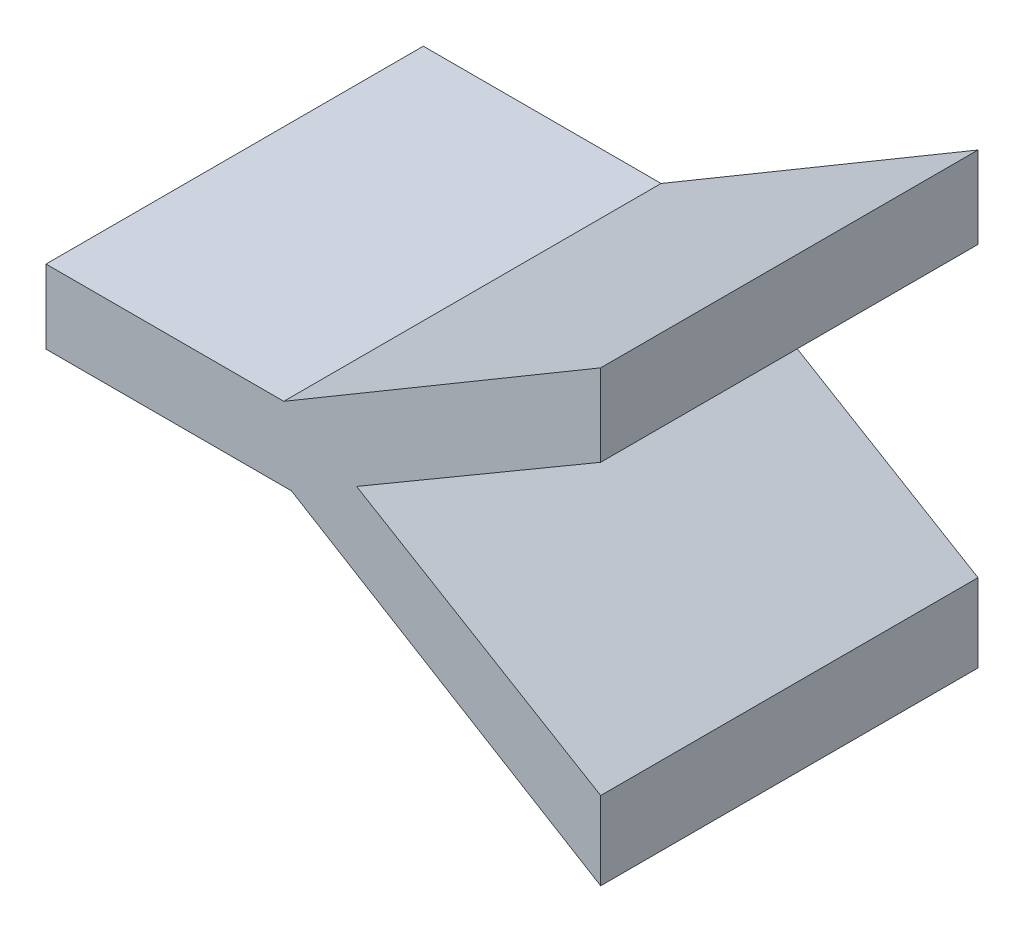
ISO-10303-21;
HEADER;
FILE_DESCRIPTION(('STEP AP214'),'2;1');
FILE_NAME('part.step','',(''),(''),'','','');
FILE_SCHEMA(('AUTOMOTIVE_DESIGN { 1 0 10303 214 1 1 1 1 }'));
ENDSEC;
DATA;
#1=APPLICATION_CONTEXT('core data for automotive mechanical design processes');
#2=APPLICATION_PROTOCOL_DEFINITION('international standard','automotive_design',2000,#1);
#3=PRODUCT_CONTEXT('',#1,'mechanical');
#4=PRODUCT('Part','Part','',(#3));
#5=PRODUCT_RELATED_PRODUCT_CATEGORY('part','',(#4));
#6=PRODUCT_DEFINITION_FORMATION('','',#4);
#7=PRODUCT_DEFINITION_CONTEXT('part definition',#1,'design');
#8=PRODUCT_DEFINITION('design','',#6,#7);
#9=PRODUCT_DEFINITION_SHAPE('','',#8);
#10=(LENGTH_UNIT() NAMED_UNIT(*) SI_UNIT(.MILLI.,.METRE.));
#11=(NAMED_UNIT(*) PLANE_ANGLE_UNIT() SI_UNIT($,.RADIAN.));
#12=(NAMED_UNIT(*) SI_UNIT($,.STERADIAN.) SOLID_ANGLE_UNIT());
#13=UNCERTAINTY_MEASURE_WITH_UNIT(LENGTH_MEASURE(1.E-05),#10,'distance_accuracy_value','');
#14=(GEOMETRIC_REPRESENTATION_CONTEXT(3) GLOBAL_UNCERTAINTY_ASSIGNED_CONTEXT((#13)) GLOBAL_UNIT_ASSIGNED_CONTEXT((#10,
#11,#12)) REPRESENTATION_CONTEXT('',''));
#15=CARTESIAN_POINT('',(0.,0.,0.));
#16=DIRECTION('',(0.,0.,1.));
#17=DIRECTION('',(1.,0.,0.));
#18=AXIS2_PLACEMENT_3D('',#15,#16,#17);
#19=CARTESIAN_POINT('',(-0.198338464719739,-1.38682786009031,0.));
#20=DIRECTION('',(0.,-1.,0.));
#21=DIRECTION('',(1.,0.,0.));
#22=AXIS2_PLACEMENT_3D('',#19,#20,#21);
#23=PLANE('',#22);
#24=DIRECTION('',(-1.,0.,0.));
#25=VECTOR('',#24,1.);
#26=CARTESIAN_POINT('',(-0.133296320443453,-1.38682786009031,0.));
#27=LINE('',#26,#25);
#28=CARTESIAN_POINT('',(-0.133296320443453,-1.38682786009031,0.));
#29=VERTEX_POINT('',#28);
#30=CARTESIAN_POINT('',(-0.198338464719739,-1.38682786009031,0.));
#31=VERTEX_POINT('',#30);
#32=EDGE_CURVE('E11',#29,#31,#27,.T.);
#33=ORIENTED_EDGE('',*,*,#32,.F.);
#34=DIRECTION('',(0.,0.,1.));
#35=VECTOR('',#34,1.);
#36=CARTESIAN_POINT('',(-0.133296320443453,-1.38682786009031,0.));
#37=LINE('',#36,#35);
#38=CARTESIAN_POINT('',(-0.133296320443453,-1.38682786009031,0.1));
#39=VERTEX_POINT('',#38);
#40=EDGE_CURVE('E159',#29,#39,#37,.T.);
#41=ORIENTED_EDGE('',*,*,#40,.T.);
#42=DIRECTION('',(1.,0.,0.));
#43=VECTOR('',#42,1.);
#44=CARTESIAN_POINT('',(-0.198338464719739,-1.38682786009031,0.1));
#45=LINE('',#44,#43);
#46=CARTESIAN_POINT('',(-0.198338464719739,-1.38682786009031,0.1));
#47=VERTEX_POINT('',#46);
#48=EDGE_CURVE('E109',#47,#39,#45,.T.);
#49=ORIENTED_EDGE('',*,*,#48,.F.);
#50=DIRECTION('',(0.,0.,1.));
#51=VECTOR('',#50,1.);
#52=CARTESIAN_POINT('',(-0.198338464719739,-1.38682786009031,0.));
#53=LINE('',#52,#51);
#54=EDGE_CURVE('E154',#31,#47,#53,.T.);
#55=ORIENTED_EDGE('',*,*,#54,.F.);
#56=EDGE_LOOP('',(#33,#41,#49,#55));
#57=FACE_BOUND('',#56,.T.);
#58=ADVANCED_FACE('F17',(#57),#23,.T.);
#59=CARTESIAN_POINT('',(-0.198338464719739,-1.36729139184615,0.));
#60=DIRECTION('',(-1.,0.,0.));
#61=DIRECTION('',(0.,-1.,0.));
#62=AXIS2_PLACEMENT_3D('',#59,#60,#61);
#63=PLANE('',#62);
#64=DIRECTION('',(0.,1.,0.));
#65=VECTOR('',#64,1.);
#66=CARTESIAN_POINT('',(-0.198338464719739,-1.38682786009031,0.));
#67=LINE('',#66,#65);
#68=CARTESIAN_POINT('',(-0.198338464719739,-1.36729139184615,0.));
#69=VERTEX_POINT('',#68);
#70=EDGE_CURVE('E24',#31,#69,#67,.T.);
#71=ORIENTED_EDGE('',*,*,#70,.F.);
#72=ORIENTED_EDGE('',*,*,#54,.T.);
#73=DIRECTION('',(0.,-1.,0.));
#74=VECTOR('',#73,1.);
#75=CARTESIAN_POINT('',(-0.198338464719739,-1.36729139184615,0.1));
#76=LINE('',#75,#74);
#77=CARTESIAN_POINT('',(-0.198338464719739,-1.36729139184615,0.1));
#78=VERTEX_POINT('',#77);
#79=EDGE_CURVE('E146',#78,#47,#76,.T.);
#80=ORIENTED_EDGE('',*,*,#79,.F.);
#81=DIRECTION('',(0.,0.,1.));
#82=VECTOR('',#81,1.);
#83=CARTESIAN_POINT('',(-0.198338464719739,-1.36729139184615,0.));
#84=LINE('',#83,#82);
#85=EDGE_CURVE('E148',#69,#78,#84,.T.);
#86=ORIENTED_EDGE('',*,*,#85,.F.);
#87=EDGE_LOOP('',(#71,#72,#80,#86));
#88=FACE_BOUND('',#87,.T.);
#89=ADVANCED_FACE('F164',(#88),#63,.T.);
#90=CARTESIAN_POINT('',(-0.135321442151689,-1.36729139184615,0.));
#91=DIRECTION('',(0.,1.,0.));
#92=DIRECTION('',(-1.,0.,0.));
#93=AXIS2_PLACEMENT_3D('',#90,#91,#92);
#94=PLANE('',#93);
#95=DIRECTION('',(1.,0.,0.));
#96=VECTOR('',#95,1.);
#97=CARTESIAN_POINT('',(-0.198338464719739,-1.36729139184615,0.));
#98=LINE('',#97,#96);
#99=CARTESIAN_POINT('',(-0.135321442151689,-1.36729139184615,0.));
#100=VERTEX_POINT('',#99);
#101=EDGE_CURVE('E156',#69,#100,#98,.T.);
#102=ORIENTED_EDGE('',*,*,#101,.F.);
#103=ORIENTED_EDGE('',*,*,#85,.T.);
#104=DIRECTION('',(-1.,0.,0.));
#105=VECTOR('',#104,1.);
#106=CARTESIAN_POINT('',(-0.135321442151689,-1.36729139184615,0.1));
#107=LINE('',#106,#105);
#108=CARTESIAN_POINT('',(-0.135321442151689,-1.36729139184615,0.1));
#109=VERTEX_POINT('',#108);
#110=EDGE_CURVE('E138',#109,#78,#107,.T.);
#111=ORIENTED_EDGE('',*,*,#110,.F.);
#112=DIRECTION('',(0.,0.,1.));
#113=VECTOR('',#112,1.);
#114=CARTESIAN_POINT('',(-0.135321442151689,-1.36729139184615,0.));
#115=LINE('',#114,#113);
#116=EDGE_CURVE('E141',#100,#109,#115,.T.);
#117=ORIENTED_EDGE('',*,*,#116,.F.);
#118=EDGE_LOOP('',(#102,#103,#111,#117));
#119=FACE_BOUND('',#118,.T.);
#120=ADVANCED_FACE('F166',(#119),#94,.T.);
#121=CARTESIAN_POINT('',(-0.0513384536630779,-1.31761634759118,0.));
#122=DIRECTION('',(-0.509099449897542,0.860707703064182,0.));
#123=DIRECTION('',(-0.860707703064182,-0.509099449897542,0.));
#124=AXIS2_PLACEMENT_3D('',#121,#122,#123);
#125=PLANE('',#124);
#126=DIRECTION('',(0.860707703064181,0.509099449897544,0.));
#127=VECTOR('',#126,1.);
#128=CARTESIAN_POINT('',(-0.135321442151689,-1.36729139184615,0.));
#129=LINE('',#128,#127);
#130=CARTESIAN_POINT('',(-0.0513384536630779,-1.31761634759118,0.));
#131=VERTEX_POINT('',#130);
#132=EDGE_CURVE('E150',#100,#131,#129,.T.);
#133=ORIENTED_EDGE('',*,*,#132,.F.);
#134=ORIENTED_EDGE('',*,*,#116,.T.);
#135=DIRECTION('',(-0.860707703064182,-0.509099449897542,0.));
#136=VECTOR('',#135,1.);
#137=CARTESIAN_POINT('',(-0.0513384536630763,-1.31761634759118,0.1));
#138=LINE('',#137,#136);
#139=CARTESIAN_POINT('',(-0.0513384536630779,-1.31761634759118,0.1));
#140=VERTEX_POINT('',#139);
#141=EDGE_CURVE('E130',#140,#109,#138,.T.);
#142=ORIENTED_EDGE('',*,*,#141,.F.);
#143=DIRECTION('',(0.,0.,1.));
#144=VECTOR('',#143,1.);
#145=CARTESIAN_POINT('',(-0.0513384536630779,-1.31761634759118,0.));
#146=LINE('',#145,#144);
#147=EDGE_CURVE('E133',#131,#140,#146,.T.);
#148=ORIENTED_EDGE('',*,*,#147,.F.);
#149=EDGE_LOOP('',(#133,#134,#142,#148));
#150=FACE_BOUND('',#149,.T.);
#151=ADVANCED_FACE('F170',(#150),#125,.T.);
#152=CARTESIAN_POINT('',(-0.0513384536630778,-1.33929706234994,0.));
#153=DIRECTION('',(1.,0.,0.));
#154=DIRECTION('',(0.,1.,0.));
#155=AXIS2_PLACEMENT_3D('',#152,#153,#154);
#156=PLANE('',#155);
#157=DIRECTION('',(0.,-1.,0.));
#158=VECTOR('',#157,1.);
#159=CARTESIAN_POINT('',(-0.0513384536630779,-1.31761634759118,0.));
#160=LINE('',#159,#158);
#161=CARTESIAN_POINT('',(-0.0513384536630778,-1.33929706234994,0.));
#162=VERTEX_POINT('',#161);
#163=EDGE_CURVE('E143',#131,#162,#160,.T.);
#164=ORIENTED_EDGE('',*,*,#163,.F.);
#165=ORIENTED_EDGE('',*,*,#147,.T.);
#166=DIRECTION('',(0.,1.,0.));
#167=VECTOR('',#166,1.);
#168=CARTESIAN_POINT('',(-0.0513384536630778,-1.33929706234994,0.1));
#169=LINE('',#168,#167);
#170=CARTESIAN_POINT('',(-0.0513384536630778,-1.33929706234994,0.1));
#171=VERTEX_POINT('',#170);
#172=EDGE_CURVE('E122',#171,#140,#169,.T.);
#173=ORIENTED_EDGE('',*,*,#172,.F.);
#174=DIRECTION('',(0.,0.,1.));
#175=VECTOR('',#174,1.);
#176=CARTESIAN_POINT('',(-0.0513384536630778,-1.33929706234994,0.));
#177=LINE('',#176,#175);
#178=EDGE_CURVE('E125',#162,#171,#177,.T.);
#179=ORIENTED_EDGE('',*,*,#178,.F.);
#180=EDGE_LOOP('',(#164,#165,#173,#179));
#181=FACE_BOUND('',#180,.T.);
#182=ADVANCED_FACE('F174',(#181),#156,.T.);
#183=CARTESIAN_POINT('',(-0.116023223520264,-1.3771787507746,0.));
#184=DIRECTION('',(0.50535240051658,-0.862913061259436,0.));
#185=DIRECTION('',(0.862913061259436,0.50535240051658,0.));
#186=AXIS2_PLACEMENT_3D('',#183,#184,#185);
#187=PLANE('',#186);
#188=DIRECTION('',(-0.862913061259437,-0.505352400516577,0.));
#189=VECTOR('',#188,1.);
#190=CARTESIAN_POINT('',(-0.0513384536630778,-1.33929706234994,0.));
#191=LINE('',#190,#189);
#192=CARTESIAN_POINT('',(-0.116023223520264,-1.3771787507746,0.));
#193=VERTEX_POINT('',#192);
#194=EDGE_CURVE('E135',#162,#193,#191,.T.);
#195=ORIENTED_EDGE('',*,*,#194,.F.);
#196=ORIENTED_EDGE('',*,*,#178,.T.);
#197=DIRECTION('',(0.862913061259433,0.505352400516584,0.));
#198=VECTOR('',#197,1.);
#199=CARTESIAN_POINT('',(-0.116023223520268,-1.37717875077459,0.1));
#200=LINE('',#199,#198);
#201=CARTESIAN_POINT('',(-0.116023223520264,-1.3771787507746,0.1));
#202=VERTEX_POINT('',#201);
#203=EDGE_CURVE('E115',#202,#171,#200,.T.);
#204=ORIENTED_EDGE('',*,*,#203,.F.);
#205=DIRECTION('',(0.,0.,1.));
#206=VECTOR('',#205,1.);
#207=CARTESIAN_POINT('',(-0.116023223520264,-1.3771787507746,0.));
#208=LINE('',#207,#206);
#209=EDGE_CURVE('E118',#193,#202,#208,.T.);
#210=ORIENTED_EDGE('',*,*,#209,.F.);
#211=EDGE_LOOP('',(#195,#196,#204,#210));
#212=FACE_BOUND('',#211,.T.);
#213=ADVANCED_FACE('F178',(#212),#187,.T.);
#214=CARTESIAN_POINT('',(-0.0513384536630776,-1.41577518803745,0.));
#215=DIRECTION('',(0.512401080946009,0.858746256029895,0.));
#216=DIRECTION('',(-0.858746256029895,0.512401080946009,0.));
#217=AXIS2_PLACEMENT_3D('',#214,#215,#216);
#218=PLANE('',#217);
#219=DIRECTION('',(0.858746256029894,-0.51240108094601,0.));
#220=VECTOR('',#219,1.);
#221=CARTESIAN_POINT('',(-0.116023223520264,-1.3771787507746,0.));
#222=LINE('',#221,#220);
#223=CARTESIAN_POINT('',(-0.0513384536630776,-1.41577518803745,0.));
#224=VERTEX_POINT('',#223);
#225=EDGE_CURVE('E127',#193,#224,#222,.T.);
#226=ORIENTED_EDGE('',*,*,#225,.F.);
#227=ORIENTED_EDGE('',*,*,#209,.T.);
#228=DIRECTION('',(-0.858746256029896,0.512401080946007,0.));
#229=VECTOR('',#228,1.);
#230=CARTESIAN_POINT('',(-0.0513384536630781,-1.41577518803745,0.1));
#231=LINE('',#230,#229);
#232=CARTESIAN_POINT('',(-0.0513384536630776,-1.41577518803745,0.1));
#233=VERTEX_POINT('',#232);
#234=EDGE_CURVE('E95',#233,#202,#231,.T.);
#235=ORIENTED_EDGE('',*,*,#234,.F.);
#236=DIRECTION('',(0.,0.,1.));
#237=VECTOR('',#236,1.);
#238=CARTESIAN_POINT('',(-0.0513384536630776,-1.41577518803745,0.));
#239=LINE('',#238,#237);
#240=EDGE_CURVE('E101',#224,#233,#239,.T.);
#241=ORIENTED_EDGE('',*,*,#240,.F.);
#242=EDGE_LOOP('',(#226,#227,#235,#241));
#243=FACE_BOUND('',#242,.T.);
#244=ADVANCED_FACE('F181',(#243),#218,.T.);
#245=CARTESIAN_POINT('',(-0.0513384536630776,-1.43650290434527,0.));
#246=DIRECTION('',(1.,0.,0.));
#247=DIRECTION('',(0.,1.,0.));
#248=AXIS2_PLACEMENT_3D('',#245,#246,#247);
#249=PLANE('',#248);
#250=DIRECTION('',(0.,-1.,0.));
#251=VECTOR('',#250,1.);
#252=CARTESIAN_POINT('',(-0.0513384536630776,-1.41577518803745,0.));
#253=LINE('',#252,#251);
#254=CARTESIAN_POINT('',(-0.0513384536630776,-1.43650290434527,0.));
#255=VERTEX_POINT('',#254);
#256=EDGE_CURVE('E120',#224,#255,#253,.T.);
#257=ORIENTED_EDGE('',*,*,#256,.F.);
#258=ORIENTED_EDGE('',*,*,#240,.T.);
#259=DIRECTION('',(0.,1.,0.));
#260=VECTOR('',#259,1.);
#261=CARTESIAN_POINT('',(-0.0513384536630776,-1.43650290434527,0.1));
#262=LINE('',#261,#260);
#263=CARTESIAN_POINT('',(-0.0513384536630776,-1.43650290434527,0.1));
#264=VERTEX_POINT('',#263);
#265=EDGE_CURVE('E96',#264,#233,#262,.T.);
#266=ORIENTED_EDGE('',*,*,#265,.F.);
#267=DIRECTION('',(0.,0.,1.));
#268=VECTOR('',#267,1.);
#269=CARTESIAN_POINT('',(-0.0513384536630776,-1.43650290434527,0.));
#270=LINE('',#269,#268);
#271=EDGE_CURVE('E85',#255,#264,#270,.T.);
#272=ORIENTED_EDGE('',*,*,#271,.F.);
#273=EDGE_LOOP('',(#257,#258,#266,#272));
#274=FACE_BOUND('',#273,.T.);
#275=ADVANCED_FACE('F99',(#274),#249,.T.);
#276=CARTESIAN_POINT('',(-0.133296320443453,-1.38682786009031,0.));
#277=DIRECTION('',(-0.518329263750965,-0.855181135397281,0.));
#278=DIRECTION('',(0.855181135397281,-0.518329263750965,0.));
#279=AXIS2_PLACEMENT_3D('',#276,#277,#278);
#280=PLANE('',#279);
#281=DIRECTION('',(-0.855181135397281,0.518329263750964,0.));
#282=VECTOR('',#281,1.);
#283=CARTESIAN_POINT('',(-0.0513384536630776,-1.43650290434527,0.));
#284=LINE('',#283,#282);
#285=EDGE_CURVE('E92',#255,#29,#284,.T.);
#286=ORIENTED_EDGE('',*,*,#285,.F.);
#287=ORIENTED_EDGE('',*,*,#271,.T.);
#288=DIRECTION('',(0.855181135397281,-0.518329263750964,0.));
#289=VECTOR('',#288,1.);
#290=CARTESIAN_POINT('',(-0.133296320443451,-1.38682786009031,0.1));
#291=LINE('',#290,#289);
#292=EDGE_CURVE('E90',#39,#264,#291,.T.);
#293=ORIENTED_EDGE('',*,*,#292,.F.);
#294=ORIENTED_EDGE('',*,*,#40,.F.);
#295=EDGE_LOOP('',(#286,#287,#293,#294));
#296=FACE_BOUND('',#295,.T.);
#297=ADVANCED_FACE('F87',(#296),#280,.T.);
#298=CARTESIAN_POINT('',(-0.108450833805613,-1.37701264080167,0.));
#299=DIRECTION('',(0.,0.,1.));
#300=DIRECTION('',(1.,0.,0.));
#301=AXIS2_PLACEMENT_3D('',#298,#299,#300);
#302=PLANE('',#301);
#303=ORIENTED_EDGE('',*,*,#285,.T.);
#304=ORIENTED_EDGE('',*,*,#32,.T.);
#305=ORIENTED_EDGE('',*,*,#70,.T.);
#306=ORIENTED_EDGE('',*,*,#101,.T.);
#307=ORIENTED_EDGE('',*,*,#132,.T.);
#308=ORIENTED_EDGE('',*,*,#163,.T.);
#309=ORIENTED_EDGE('',*,*,#194,.T.);
#310=ORIENTED_EDGE('',*,*,#225,.T.);
#311=ORIENTED_EDGE('',*,*,#256,.T.);
#312=EDGE_LOOP('',(#303,#304,#305,#306,#307,#308,#309,#310,#311));
#313=FACE_BOUND('',#312,.T.);
#314=ADVANCED_FACE('F161',(#313),#302,.F.);
#315=CARTESIAN_POINT('',(-0.108450833805613,-1.37701264080167,0.1));
#316=DIRECTION('',(0.,0.,1.));
#317=DIRECTION('',(1.,0.,0.));
#318=AXIS2_PLACEMENT_3D('',#315,#316,#317);
#319=PLANE('',#318);
#320=ORIENTED_EDGE('',*,*,#292,.T.);
#321=ORIENTED_EDGE('',*,*,#265,.T.);
#322=ORIENTED_EDGE('',*,*,#234,.T.);
#323=ORIENTED_EDGE('',*,*,#203,.T.);
#324=ORIENTED_EDGE('',*,*,#172,.T.);
#325=ORIENTED_EDGE('',*,*,#141,.T.);
#326=ORIENTED_EDGE('',*,*,#110,.T.);
#327=ORIENTED_EDGE('',*,*,#79,.T.);
#328=ORIENTED_EDGE('',*,*,#48,.T.);
#329=EDGE_LOOP('',(#320,#321,#322,#323,#324,#325,#326,#327,#328));
#330=FACE_BOUND('',#329,.T.);
#331=ADVANCED_FACE('F106',(#330),#319,.T.);
#332=CLOSED_SHELL('',(#58,#89,#120,#151,#182,#213,#244,#275,#297,#314,#331));
#333=MANIFOLD_SOLID_BREP('B1',#332);
#334=ADVANCED_BREP_SHAPE_REPRESENTATION('',(#18,#333),#14);
#335=SHAPE_DEFINITION_REPRESENTATION(#9,#334);
ENDSEC;
END-ISO-10303-21;
